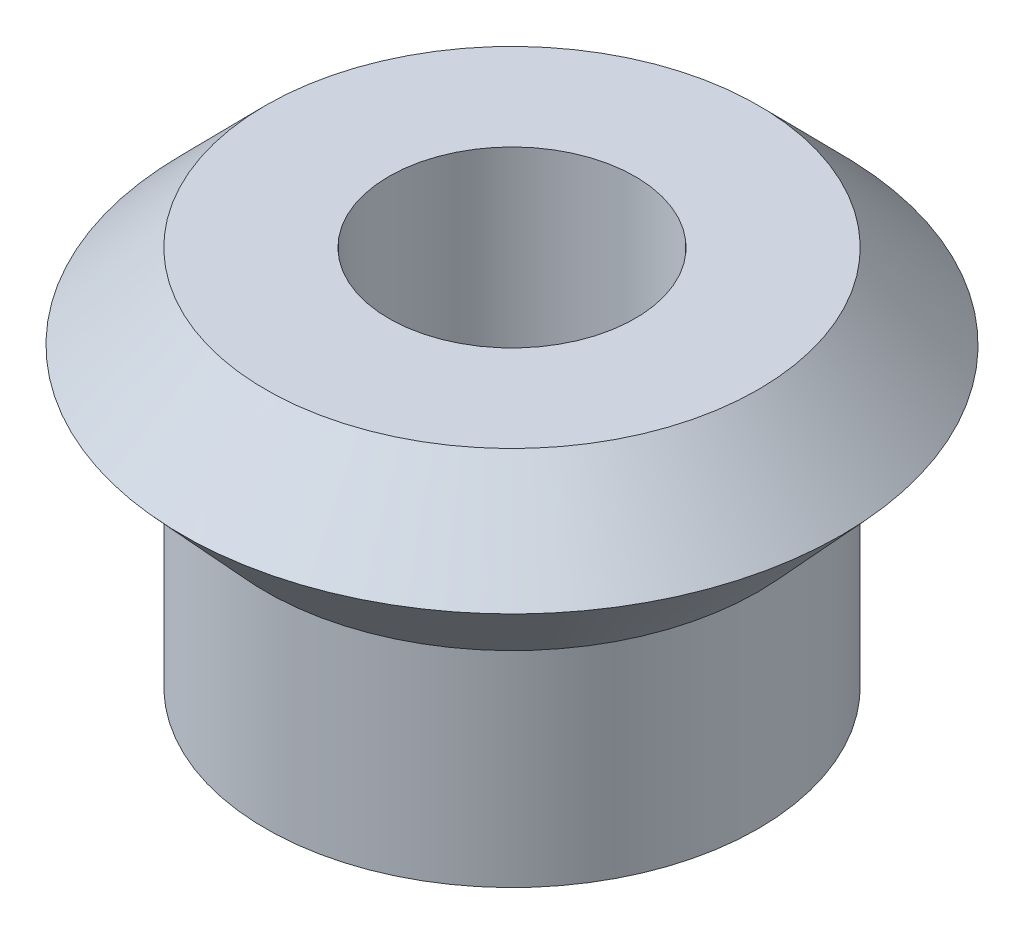
ISO-10303-21;
HEADER;
FILE_DESCRIPTION(('STEP AP214'),'2;1');
FILE_NAME('part.step','',(''),(''),'','','');
FILE_SCHEMA(('AUTOMOTIVE_DESIGN { 1 0 10303 214 1 1 1 1 }'));
ENDSEC;
DATA;
#1=APPLICATION_CONTEXT('core data for automotive mechanical design processes');
#2=APPLICATION_PROTOCOL_DEFINITION('international standard','automotive_design',2000,#1);
#3=PRODUCT_CONTEXT('',#1,'mechanical');
#4=PRODUCT('Part','Part','',(#3));
#5=PRODUCT_RELATED_PRODUCT_CATEGORY('part','',(#4));
#6=PRODUCT_DEFINITION_FORMATION('','',#4);
#7=PRODUCT_DEFINITION_CONTEXT('part definition',#1,'design');
#8=PRODUCT_DEFINITION('design','',#6,#7);
#9=PRODUCT_DEFINITION_SHAPE('','',#8);
#10=(LENGTH_UNIT() NAMED_UNIT(*) SI_UNIT(.MILLI.,.METRE.));
#11=(NAMED_UNIT(*) PLANE_ANGLE_UNIT() SI_UNIT($,.RADIAN.));
#12=(NAMED_UNIT(*) SI_UNIT($,.STERADIAN.) SOLID_ANGLE_UNIT());
#13=UNCERTAINTY_MEASURE_WITH_UNIT(LENGTH_MEASURE(1.E-05),#10,'distance_accuracy_value','');
#14=(GEOMETRIC_REPRESENTATION_CONTEXT(3) GLOBAL_UNCERTAINTY_ASSIGNED_CONTEXT((#13)) GLOBAL_UNIT_ASSIGNED_CONTEXT((#10,
#11,#12)) REPRESENTATION_CONTEXT('',''));
#15=CARTESIAN_POINT('',(0.,0.,0.));
#16=DIRECTION('',(0.,0.,1.));
#17=DIRECTION('',(1.,0.,0.));
#18=AXIS2_PLACEMENT_3D('',#15,#16,#17);
#19=CARTESIAN_POINT('',(12.,18.53,0.));
#20=DIRECTION('',(0.,1.,0.));
#21=DIRECTION('',(-1.,0.,0.));
#22=AXIS2_PLACEMENT_3D('',#19,#20,#21);
#23=CYLINDRICAL_SURFACE('',#22,12.);
#24=CARTESIAN_POINT('',(12.,0.,0.));
#25=DIRECTION('',(0.,1.,0.));
#26=DIRECTION('',(-1.,0.,0.));
#27=AXIS2_PLACEMENT_3D('',#24,#25,#26);
#28=CIRCLE('',#27,12.);
#29=CARTESIAN_POINT('',(0.,0.,0.));
#30=VERTEX_POINT('',#29);
#31=EDGE_CURVE('E61',#30,#30,#28,.T.);
#32=ORIENTED_EDGE('',*,*,#31,.T.);
#33=EDGE_LOOP('',(#32));
#34=FACE_BOUND('',#33,.T.);
#35=CARTESIAN_POINT('',(12.,10.,0.));
#36=DIRECTION('',(0.,1.,0.));
#37=DIRECTION('',(-1.,0.,0.));
#38=AXIS2_PLACEMENT_3D('',#35,#36,#37);
#39=CIRCLE('',#38,12.);
#40=CARTESIAN_POINT('',(0.,10.,0.));
#41=VERTEX_POINT('',#40);
#42=EDGE_CURVE('E10',#41,#41,#39,.T.);
#43=ORIENTED_EDGE('',*,*,#42,.F.);
#44=EDGE_LOOP('',(#43));
#45=FACE_BOUND('',#44,.T.);
#46=ADVANCED_FACE('F39',(#34,#45),#23,.T.);
#47=CARTESIAN_POINT('',(12.,14.4177369772317,0.));
#48=DIRECTION('',(0.,1.,0.));
#49=DIRECTION('',(-1.,0.,0.));
#50=AXIS2_PLACEMENT_3D('',#47,#48,#49);
#51=CONICAL_SURFACE('',#50,16.06,0.743225956919002);
#52=ORIENTED_EDGE('',*,*,#42,.T.);
#53=EDGE_LOOP('',(#52));
#54=FACE_BOUND('',#53,.T.);
#55=CARTESIAN_POINT('',(12.,14.4177369772317,0.));
#56=DIRECTION('',(0.,1.,0.));
#57=DIRECTION('',(-1.,0.,0.));
#58=AXIS2_PLACEMENT_3D('',#55,#56,#57);
#59=CIRCLE('',#58,16.06);
#60=CARTESIAN_POINT('',(-4.06,14.4177369772317,0.));
#61=VERTEX_POINT('',#60);
#62=EDGE_CURVE('E45',#61,#61,#59,.T.);
#63=ORIENTED_EDGE('',*,*,#62,.F.);
#64=EDGE_LOOP('',(#63));
#65=FACE_BOUND('',#64,.T.);
#66=ADVANCED_FACE('F79',(#54,#65),#51,.T.);
#67=CARTESIAN_POINT('',(12.,18.53,0.));
#68=DIRECTION('',(0.,-1.,0.));
#69=DIRECTION('',(1.,0.,0.));
#70=AXIS2_PLACEMENT_3D('',#67,#68,#69);
#71=CONICAL_SURFACE('',#70,12.,0.779003079177563);
#72=ORIENTED_EDGE('',*,*,#62,.T.);
#73=EDGE_LOOP('',(#72));
#74=FACE_BOUND('',#73,.T.);
#75=CARTESIAN_POINT('',(12.,18.53,0.));
#76=DIRECTION('',(0.,1.,0.));
#77=DIRECTION('',(-1.,0.,0.));
#78=AXIS2_PLACEMENT_3D('',#75,#76,#77);
#79=CIRCLE('',#78,12.);
#80=CARTESIAN_POINT('',(0.,18.53,0.));
#81=VERTEX_POINT('',#80);
#82=EDGE_CURVE('E49',#81,#81,#79,.T.);
#83=ORIENTED_EDGE('',*,*,#82,.F.);
#84=EDGE_LOOP('',(#83));
#85=FACE_BOUND('',#84,.T.);
#86=ADVANCED_FACE('F83',(#74,#85),#71,.T.);
#87=CARTESIAN_POINT('',(0.,18.53,0.));
#88=DIRECTION('',(0.,1.,0.));
#89=DIRECTION('',(-1.,0.,0.));
#90=AXIS2_PLACEMENT_3D('',#87,#88,#89);
#91=PLANE('',#90);
#92=ORIENTED_EDGE('',*,*,#82,.T.);
#93=EDGE_LOOP('',(#92));
#94=FACE_BOUND('',#93,.T.);
#95=CARTESIAN_POINT('',(12.,18.53,0.));
#96=DIRECTION('',(0.,1.,0.));
#97=DIRECTION('',(-1.,0.,0.));
#98=AXIS2_PLACEMENT_3D('',#95,#96,#97);
#99=CIRCLE('',#98,6.);
#100=CARTESIAN_POINT('',(6.,18.53,0.));
#101=VERTEX_POINT('',#100);
#102=EDGE_CURVE('E53',#101,#101,#99,.T.);
#103=ORIENTED_EDGE('',*,*,#102,.F.);
#104=EDGE_LOOP('',(#103));
#105=FACE_BOUND('',#104,.T.);
#106=ADVANCED_FACE('F75',(#94,#105),#91,.T.);
#107=CARTESIAN_POINT('',(12.,18.53,0.));
#108=DIRECTION('',(0.,1.,0.));
#109=DIRECTION('',(-1.,0.,0.));
#110=AXIS2_PLACEMENT_3D('',#107,#108,#109);
#111=CYLINDRICAL_SURFACE('',#110,6.);
#112=ORIENTED_EDGE('',*,*,#102,.T.);
#113=EDGE_LOOP('',(#112));
#114=FACE_BOUND('',#113,.T.);
#115=CARTESIAN_POINT('',(12.,0.,0.));
#116=DIRECTION('',(0.,1.,0.));
#117=DIRECTION('',(-1.,0.,0.));
#118=AXIS2_PLACEMENT_3D('',#115,#116,#117);
#119=CIRCLE('',#118,6.);
#120=CARTESIAN_POINT('',(6.,0.,0.));
#121=VERTEX_POINT('',#120);
#122=EDGE_CURVE('E58',#121,#121,#119,.T.);
#123=ORIENTED_EDGE('',*,*,#122,.F.);
#124=EDGE_LOOP('',(#123));
#125=FACE_BOUND('',#124,.T.);
#126=ADVANCED_FACE('F69',(#114,#125),#111,.F.);
#127=CARTESIAN_POINT('',(0.,0.,0.));
#128=DIRECTION('',(0.,-1.,0.));
#129=DIRECTION('',(1.,0.,0.));
#130=AXIS2_PLACEMENT_3D('',#127,#128,#129);
#131=PLANE('',#130);
#132=ORIENTED_EDGE('',*,*,#122,.T.);
#133=EDGE_LOOP('',(#132));
#134=FACE_BOUND('',#133,.T.);
#135=ORIENTED_EDGE('',*,*,#31,.F.);
#136=EDGE_LOOP('',(#135));
#137=FACE_BOUND('',#136,.T.);
#138=ADVANCED_FACE('F67',(#134,#137),#131,.T.);
#139=CLOSED_SHELL('',(#46,#66,#86,#106,#126,#138));
#140=MANIFOLD_SOLID_BREP('B2',#139);
#141=ADVANCED_BREP_SHAPE_REPRESENTATION('',(#18,#140),#14);
#142=SHAPE_DEFINITION_REPRESENTATION(#9,#141);
ENDSEC;
END-ISO-10303-21;
